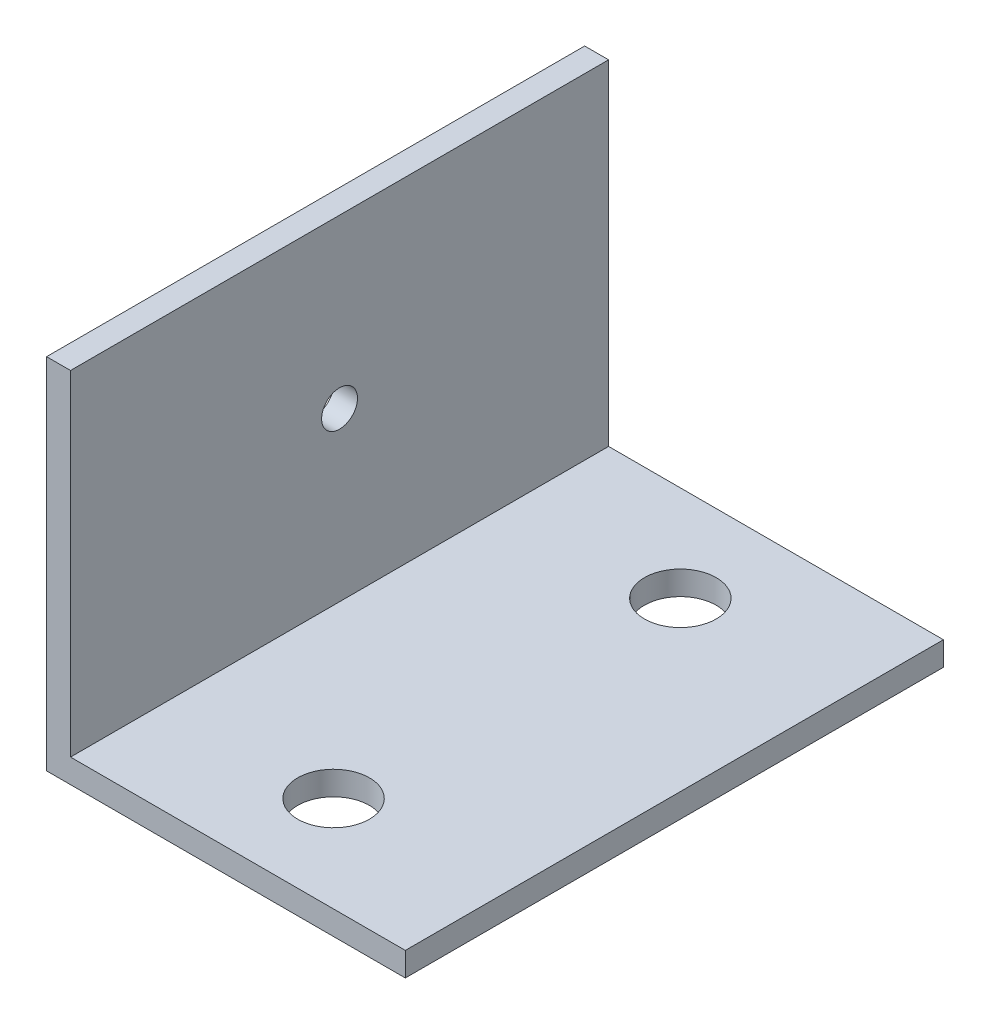
ISO-10303-21;
HEADER;
FILE_DESCRIPTION(('STEP AP214'),'2;1');
FILE_NAME('part.step','',(''),(''),'','','');
FILE_SCHEMA(('AUTOMOTIVE_DESIGN { 1 0 10303 214 1 1 1 1 }'));
ENDSEC;
DATA;
#1=APPLICATION_CONTEXT('core data for automotive mechanical design processes');
#2=APPLICATION_PROTOCOL_DEFINITION('international standard','automotive_design',2000,#1);
#3=PRODUCT_CONTEXT('',#1,'mechanical');
#4=PRODUCT('Part','Part','',(#3));
#5=PRODUCT_RELATED_PRODUCT_CATEGORY('part','',(#4));
#6=PRODUCT_DEFINITION_FORMATION('','',#4);
#7=PRODUCT_DEFINITION_CONTEXT('part definition',#1,'design');
#8=PRODUCT_DEFINITION('design','',#6,#7);
#9=PRODUCT_DEFINITION_SHAPE('','',#8);
#10=(LENGTH_UNIT() NAMED_UNIT(*) SI_UNIT(.MILLI.,.METRE.));
#11=(NAMED_UNIT(*) PLANE_ANGLE_UNIT() SI_UNIT($,.RADIAN.));
#12=(NAMED_UNIT(*) SI_UNIT($,.STERADIAN.) SOLID_ANGLE_UNIT());
#13=UNCERTAINTY_MEASURE_WITH_UNIT(LENGTH_MEASURE(1.E-05),#10,'distance_accuracy_value','');
#14=(GEOMETRIC_REPRESENTATION_CONTEXT(3) GLOBAL_UNCERTAINTY_ASSIGNED_CONTEXT((#13)) GLOBAL_UNIT_ASSIGNED_CONTEXT((#10,
#11,#12)) REPRESENTATION_CONTEXT('',''));
#15=CARTESIAN_POINT('',(0.,0.,0.));
#16=DIRECTION('',(0.,0.,1.));
#17=DIRECTION('',(1.,0.,0.));
#18=AXIS2_PLACEMENT_3D('',#15,#16,#17);
#19=CARTESIAN_POINT('',(-61.470895832236,45.7822173569799,45.));
#20=DIRECTION('',(0.,-1.,0.));
#21=DIRECTION('',(0.,0.,-1.));
#22=AXIS2_PLACEMENT_3D('',#19,#20,#21);
#23=PLANE('',#22);
#24=DIRECTION('',(-1.,0.,0.));
#25=VECTOR('',#24,1.);
#26=CARTESIAN_POINT('',(-61.470895832236,45.7822173569799,0.));
#27=LINE('',#26,#25);
#28=CARTESIAN_POINT('',(-61.470895832236,45.7822173569799,0.));
#29=VERTEX_POINT('',#28);
#30=CARTESIAN_POINT('',(-63.470895832236,45.7822173569799,0.));
#31=VERTEX_POINT('',#30);
#32=EDGE_CURVE('E117',#29,#31,#27,.T.);
#33=ORIENTED_EDGE('',*,*,#32,.T.);
#34=DIRECTION('',(0.,0.,-1.));
#35=VECTOR('',#34,1.);
#36=CARTESIAN_POINT('',(-63.470895832236,45.7822173569799,45.));
#37=LINE('',#36,#35);
#38=CARTESIAN_POINT('',(-63.470895832236,45.7822173569799,45.));
#39=VERTEX_POINT('',#38);
#40=EDGE_CURVE('E11',#39,#31,#37,.T.);
#41=ORIENTED_EDGE('',*,*,#40,.F.);
#42=DIRECTION('',(-1.,0.,0.));
#43=VECTOR('',#42,1.);
#44=CARTESIAN_POINT('',(-61.470895832236,45.7822173569799,45.));
#45=LINE('',#44,#43);
#46=CARTESIAN_POINT('',(-61.470895832236,45.7822173569799,45.));
#47=VERTEX_POINT('',#46);
#48=EDGE_CURVE('E128',#47,#39,#45,.T.);
#49=ORIENTED_EDGE('',*,*,#48,.F.);
#50=DIRECTION('',(0.,0.,-1.));
#51=VECTOR('',#50,1.);
#52=CARTESIAN_POINT('',(-61.470895832236,45.7822173569799,45.));
#53=LINE('',#52,#51);
#54=EDGE_CURVE('E113',#47,#29,#53,.T.);
#55=ORIENTED_EDGE('',*,*,#54,.T.);
#56=EDGE_LOOP('',(#33,#41,#49,#55));
#57=FACE_BOUND('',#56,.T.);
#58=ADVANCED_FACE('F33',(#57),#23,.F.);
#59=CARTESIAN_POINT('',(-63.470895832236,45.7822173569799,45.));
#60=DIRECTION('',(1.,0.,0.));
#61=DIRECTION('',(0.,0.,-1.));
#62=AXIS2_PLACEMENT_3D('',#59,#60,#61);
#63=PLANE('',#62);
#64=CARTESIAN_POINT('',(-63.470895832236,31.7822173569798,22.5));
#65=DIRECTION('',(1.,0.,0.));
#66=DIRECTION('',(0.,0.,-1.));
#67=AXIS2_PLACEMENT_3D('',#64,#65,#66);
#68=CIRCLE('',#67,1.5);
#69=CARTESIAN_POINT('',(-63.470895832236,31.7822173569798,21.));
#70=VERTEX_POINT('',#69);
#71=EDGE_CURVE('E236',#70,#70,#68,.T.);
#72=ORIENTED_EDGE('',*,*,#71,.T.);
#73=EDGE_LOOP('',(#72));
#74=FACE_BOUND('',#73,.T.);
#75=DIRECTION('',(0.,-1.,0.));
#76=VECTOR('',#75,1.);
#77=CARTESIAN_POINT('',(-63.470895832236,45.7822173569799,0.));
#78=LINE('',#77,#76);
#79=CARTESIAN_POINT('',(-63.470895832236,15.7822173569799,0.));
#80=VERTEX_POINT('',#79);
#81=EDGE_CURVE('E120',#31,#80,#78,.T.);
#82=ORIENTED_EDGE('',*,*,#81,.T.);
#83=DIRECTION('',(0.,0.,-1.));
#84=VECTOR('',#83,1.);
#85=CARTESIAN_POINT('',(-63.470895832236,15.7822173569799,45.));
#86=LINE('',#85,#84);
#87=CARTESIAN_POINT('',(-63.470895832236,15.7822173569799,45.));
#88=VERTEX_POINT('',#87);
#89=EDGE_CURVE('E41',#88,#80,#86,.T.);
#90=ORIENTED_EDGE('',*,*,#89,.F.);
#91=DIRECTION('',(0.,-1.,0.));
#92=VECTOR('',#91,1.);
#93=CARTESIAN_POINT('',(-63.470895832236,45.7822173569799,45.));
#94=LINE('',#93,#92);
#95=EDGE_CURVE('E86',#39,#88,#94,.T.);
#96=ORIENTED_EDGE('',*,*,#95,.F.);
#97=ORIENTED_EDGE('',*,*,#40,.T.);
#98=EDGE_LOOP('',(#82,#90,#96,#97));
#99=FACE_BOUND('',#98,.T.);
#100=ADVANCED_FACE('F155',(#74,#99),#63,.F.);
#101=CARTESIAN_POINT('',(-63.470895832236,15.7822173569799,45.));
#102=DIRECTION('',(0.,1.,0.));
#103=DIRECTION('',(0.,0.,1.));
#104=AXIS2_PLACEMENT_3D('',#101,#102,#103);
#105=PLANE('',#104);
#106=CARTESIAN_POINT('',(-47.470895832236,15.7822173569799,37.));
#107=DIRECTION('',(0.,1.,0.));
#108=DIRECTION('',(0.,0.,1.));
#109=AXIS2_PLACEMENT_3D('',#106,#107,#108);
#110=CIRCLE('',#109,3.);
#111=CARTESIAN_POINT('',(-47.470895832236,15.7822173569799,40.));
#112=VERTEX_POINT('',#111);
#113=EDGE_CURVE('E245',#112,#112,#110,.T.);
#114=ORIENTED_EDGE('',*,*,#113,.T.);
#115=EDGE_LOOP('',(#114));
#116=FACE_BOUND('',#115,.T.);
#117=CARTESIAN_POINT('',(-47.470895832236,15.7822173569799,8.));
#118=DIRECTION('',(0.,1.,0.));
#119=DIRECTION('',(0.,0.,1.));
#120=AXIS2_PLACEMENT_3D('',#117,#118,#119);
#121=CIRCLE('',#120,3.);
#122=CARTESIAN_POINT('',(-47.470895832236,15.7822173569799,11.));
#123=VERTEX_POINT('',#122);
#124=EDGE_CURVE('E121',#123,#123,#121,.T.);
#125=ORIENTED_EDGE('',*,*,#124,.T.);
#126=EDGE_LOOP('',(#125));
#127=FACE_BOUND('',#126,.T.);
#128=DIRECTION('',(1.,0.,0.));
#129=VECTOR('',#128,1.);
#130=CARTESIAN_POINT('',(-63.470895832236,15.7822173569799,0.));
#131=LINE('',#130,#129);
#132=CARTESIAN_POINT('',(-33.470895832236,15.7822173569799,0.));
#133=VERTEX_POINT('',#132);
#134=EDGE_CURVE('E123',#80,#133,#131,.T.);
#135=ORIENTED_EDGE('',*,*,#134,.T.);
#136=DIRECTION('',(0.,0.,-1.));
#137=VECTOR('',#136,1.);
#138=CARTESIAN_POINT('',(-33.470895832236,15.7822173569799,45.));
#139=LINE('',#138,#137);
#140=CARTESIAN_POINT('',(-33.470895832236,15.7822173569799,45.));
#141=VERTEX_POINT('',#140);
#142=EDGE_CURVE('E108',#141,#133,#139,.T.);
#143=ORIENTED_EDGE('',*,*,#142,.F.);
#144=DIRECTION('',(1.,0.,0.));
#145=VECTOR('',#144,1.);
#146=CARTESIAN_POINT('',(-63.470895832236,15.7822173569799,45.));
#147=LINE('',#146,#145);
#148=EDGE_CURVE('E99',#88,#141,#147,.T.);
#149=ORIENTED_EDGE('',*,*,#148,.F.);
#150=ORIENTED_EDGE('',*,*,#89,.T.);
#151=EDGE_LOOP('',(#135,#143,#149,#150));
#152=FACE_BOUND('',#151,.T.);
#153=ADVANCED_FACE('F134',(#116,#127,#152),#105,.F.);
#154=CARTESIAN_POINT('',(-33.470895832236,15.7822173569799,45.));
#155=DIRECTION('',(-1.,0.,0.));
#156=DIRECTION('',(0.,0.,1.));
#157=AXIS2_PLACEMENT_3D('',#154,#155,#156);
#158=PLANE('',#157);
#159=DIRECTION('',(0.,1.,0.));
#160=VECTOR('',#159,1.);
#161=CARTESIAN_POINT('',(-33.470895832236,15.7822173569799,0.));
#162=LINE('',#161,#160);
#163=CARTESIAN_POINT('',(-33.470895832236,17.7822173569799,0.));
#164=VERTEX_POINT('',#163);
#165=EDGE_CURVE('E107',#133,#164,#162,.T.);
#166=ORIENTED_EDGE('',*,*,#165,.T.);
#167=DIRECTION('',(0.,0.,-1.));
#168=VECTOR('',#167,1.);
#169=CARTESIAN_POINT('',(-33.470895832236,17.7822173569799,45.));
#170=LINE('',#169,#168);
#171=CARTESIAN_POINT('',(-33.470895832236,17.7822173569799,45.));
#172=VERTEX_POINT('',#171);
#173=EDGE_CURVE('E104',#172,#164,#170,.T.);
#174=ORIENTED_EDGE('',*,*,#173,.F.);
#175=DIRECTION('',(0.,1.,0.));
#176=VECTOR('',#175,1.);
#177=CARTESIAN_POINT('',(-33.470895832236,15.7822173569799,45.));
#178=LINE('',#177,#176);
#179=EDGE_CURVE('E93',#141,#172,#178,.T.);
#180=ORIENTED_EDGE('',*,*,#179,.F.);
#181=ORIENTED_EDGE('',*,*,#142,.T.);
#182=EDGE_LOOP('',(#166,#174,#180,#181));
#183=FACE_BOUND('',#182,.T.);
#184=ADVANCED_FACE('F105',(#183),#158,.F.);
#185=CARTESIAN_POINT('',(-33.470895832236,17.7822173569799,45.));
#186=DIRECTION('',(0.,-1.,0.));
#187=DIRECTION('',(1.,0.,0.));
#188=AXIS2_PLACEMENT_3D('',#185,#186,#187);
#189=PLANE('',#188);
#190=CARTESIAN_POINT('',(-47.470895832236,17.7822173569799,37.));
#191=DIRECTION('',(0.,1.,0.));
#192=DIRECTION('',(0.,0.,1.));
#193=AXIS2_PLACEMENT_3D('',#190,#191,#192);
#194=CIRCLE('',#193,3.);
#195=CARTESIAN_POINT('',(-47.470895832236,17.7822173569799,40.));
#196=VERTEX_POINT('',#195);
#197=EDGE_CURVE('E240',#196,#196,#194,.T.);
#198=ORIENTED_EDGE('',*,*,#197,.F.);
#199=EDGE_LOOP('',(#198));
#200=FACE_BOUND('',#199,.T.);
#201=CARTESIAN_POINT('',(-47.470895832236,17.7822173569799,8.));
#202=DIRECTION('',(0.,1.,0.));
#203=DIRECTION('',(0.,0.,1.));
#204=AXIS2_PLACEMENT_3D('',#201,#202,#203);
#205=CIRCLE('',#204,3.);
#206=CARTESIAN_POINT('',(-47.470895832236,17.7822173569799,11.));
#207=VERTEX_POINT('',#206);
#208=EDGE_CURVE('E248',#207,#207,#205,.T.);
#209=ORIENTED_EDGE('',*,*,#208,.F.);
#210=EDGE_LOOP('',(#209));
#211=FACE_BOUND('',#210,.T.);
#212=DIRECTION('',(-1.,0.,0.));
#213=VECTOR('',#212,1.);
#214=CARTESIAN_POINT('',(-33.470895832236,17.7822173569799,0.));
#215=LINE('',#214,#213);
#216=CARTESIAN_POINT('',(-61.470895832236,17.7822173569799,0.));
#217=VERTEX_POINT('',#216);
#218=EDGE_CURVE('E72',#164,#217,#215,.T.);
#219=ORIENTED_EDGE('',*,*,#218,.T.);
#220=DIRECTION('',(0.,0.,-1.));
#221=VECTOR('',#220,1.);
#222=CARTESIAN_POINT('',(-61.470895832236,17.7822173569799,45.));
#223=LINE('',#222,#221);
#224=CARTESIAN_POINT('',(-61.470895832236,17.7822173569799,45.));
#225=VERTEX_POINT('',#224);
#226=EDGE_CURVE('E109',#225,#217,#223,.T.);
#227=ORIENTED_EDGE('',*,*,#226,.F.);
#228=DIRECTION('',(-1.,0.,0.));
#229=VECTOR('',#228,1.);
#230=CARTESIAN_POINT('',(-33.470895832236,17.7822173569799,45.));
#231=LINE('',#230,#229);
#232=EDGE_CURVE('E97',#172,#225,#231,.T.);
#233=ORIENTED_EDGE('',*,*,#232,.F.);
#234=ORIENTED_EDGE('',*,*,#173,.T.);
#235=EDGE_LOOP('',(#219,#227,#233,#234));
#236=FACE_BOUND('',#235,.T.);
#237=ADVANCED_FACE('F111',(#200,#211,#236),#189,.F.);
#238=CARTESIAN_POINT('',(-61.470895832236,17.7822173569799,45.));
#239=DIRECTION('',(-1.,0.,0.));
#240=DIRECTION('',(0.,0.,1.));
#241=AXIS2_PLACEMENT_3D('',#238,#239,#240);
#242=PLANE('',#241);
#243=CARTESIAN_POINT('',(-61.470895832236,31.7822173569798,22.5));
#244=DIRECTION('',(1.,0.,0.));
#245=DIRECTION('',(0.,0.,-1.));
#246=AXIS2_PLACEMENT_3D('',#243,#244,#245);
#247=CIRCLE('',#246,1.5);
#248=CARTESIAN_POINT('',(-61.470895832236,31.7822173569798,21.));
#249=VERTEX_POINT('',#248);
#250=EDGE_CURVE('E238',#249,#249,#247,.T.);
#251=ORIENTED_EDGE('',*,*,#250,.F.);
#252=EDGE_LOOP('',(#251));
#253=FACE_BOUND('',#252,.T.);
#254=DIRECTION('',(0.,1.,0.));
#255=VECTOR('',#254,1.);
#256=CARTESIAN_POINT('',(-61.470895832236,17.7822173569799,0.));
#257=LINE('',#256,#255);
#258=EDGE_CURVE('E78',#217,#29,#257,.T.);
#259=ORIENTED_EDGE('',*,*,#258,.T.);
#260=ORIENTED_EDGE('',*,*,#54,.F.);
#261=DIRECTION('',(0.,1.,0.));
#262=VECTOR('',#261,1.);
#263=CARTESIAN_POINT('',(-61.470895832236,17.7822173569799,45.));
#264=LINE('',#263,#262);
#265=EDGE_CURVE('E49',#225,#47,#264,.T.);
#266=ORIENTED_EDGE('',*,*,#265,.F.);
#267=ORIENTED_EDGE('',*,*,#226,.T.);
#268=EDGE_LOOP('',(#259,#260,#266,#267));
#269=FACE_BOUND('',#268,.T.);
#270=ADVANCED_FACE('F141',(#253,#269),#242,.F.);
#271=CARTESIAN_POINT('',(0.,0.,45.));
#272=DIRECTION('',(0.,0.,1.));
#273=DIRECTION('',(1.,0.,0.));
#274=AXIS2_PLACEMENT_3D('',#271,#272,#273);
#275=PLANE('',#274);
#276=ORIENTED_EDGE('',*,*,#48,.T.);
#277=ORIENTED_EDGE('',*,*,#95,.T.);
#278=ORIENTED_EDGE('',*,*,#148,.T.);
#279=ORIENTED_EDGE('',*,*,#179,.T.);
#280=ORIENTED_EDGE('',*,*,#232,.T.);
#281=ORIENTED_EDGE('',*,*,#265,.T.);
#282=EDGE_LOOP('',(#276,#277,#278,#279,#280,#281));
#283=FACE_BOUND('',#282,.T.);
#284=ADVANCED_FACE('F95',(#283),#275,.T.);
#285=CARTESIAN_POINT('',(0.,0.,0.));
#286=DIRECTION('',(0.,0.,1.));
#287=DIRECTION('',(1.,0.,0.));
#288=AXIS2_PLACEMENT_3D('',#285,#286,#287);
#289=PLANE('',#288);
#290=ORIENTED_EDGE('',*,*,#32,.F.);
#291=ORIENTED_EDGE('',*,*,#258,.F.);
#292=ORIENTED_EDGE('',*,*,#218,.F.);
#293=ORIENTED_EDGE('',*,*,#165,.F.);
#294=ORIENTED_EDGE('',*,*,#134,.F.);
#295=ORIENTED_EDGE('',*,*,#81,.F.);
#296=EDGE_LOOP('',(#290,#291,#292,#293,#294,#295));
#297=FACE_BOUND('',#296,.T.);
#298=ADVANCED_FACE('F137',(#297),#289,.F.);
#299=CARTESIAN_POINT('',(-47.470895832236,17.7822173569799,8.));
#300=DIRECTION('',(0.,1.,0.));
#301=DIRECTION('',(0.,0.,1.));
#302=AXIS2_PLACEMENT_3D('',#299,#300,#301);
#303=CYLINDRICAL_SURFACE('',#302,3.);
#304=ORIENTED_EDGE('',*,*,#124,.F.);
#305=EDGE_LOOP('',(#304));
#306=FACE_BOUND('',#305,.T.);
#307=ORIENTED_EDGE('',*,*,#208,.T.);
#308=EDGE_LOOP('',(#307));
#309=FACE_BOUND('',#308,.T.);
#310=ADVANCED_FACE('F186',(#306,#309),#303,.F.);
#311=CARTESIAN_POINT('',(-47.470895832236,17.7822173569799,37.));
#312=DIRECTION('',(0.,1.,0.));
#313=DIRECTION('',(0.,0.,1.));
#314=AXIS2_PLACEMENT_3D('',#311,#312,#313);
#315=CYLINDRICAL_SURFACE('',#314,3.);
#316=ORIENTED_EDGE('',*,*,#113,.F.);
#317=EDGE_LOOP('',(#316));
#318=FACE_BOUND('',#317,.T.);
#319=ORIENTED_EDGE('',*,*,#197,.T.);
#320=EDGE_LOOP('',(#319));
#321=FACE_BOUND('',#320,.T.);
#322=ADVANCED_FACE('F191',(#318,#321),#315,.F.);
#323=CARTESIAN_POINT('',(-61.470895832236,31.7822173569798,22.5));
#324=DIRECTION('',(1.,0.,0.));
#325=DIRECTION('',(0.,0.,-1.));
#326=AXIS2_PLACEMENT_3D('',#323,#324,#325);
#327=CYLINDRICAL_SURFACE('',#326,1.5);
#328=ORIENTED_EDGE('',*,*,#71,.F.);
#329=EDGE_LOOP('',(#328));
#330=FACE_BOUND('',#329,.T.);
#331=ORIENTED_EDGE('',*,*,#250,.T.);
#332=EDGE_LOOP('',(#331));
#333=FACE_BOUND('',#332,.T.);
#334=ADVANCED_FACE('F202',(#330,#333),#327,.F.);
#335=CLOSED_SHELL('',(#58,#100,#153,#184,#237,#270,#284,#298,#310,#322,#334));
#336=MANIFOLD_SOLID_BREP('B2',#335);
#337=ADVANCED_BREP_SHAPE_REPRESENTATION('',(#18,#336),#14);
#338=SHAPE_DEFINITION_REPRESENTATION(#9,#337);
ENDSEC;
END-ISO-10303-21;
